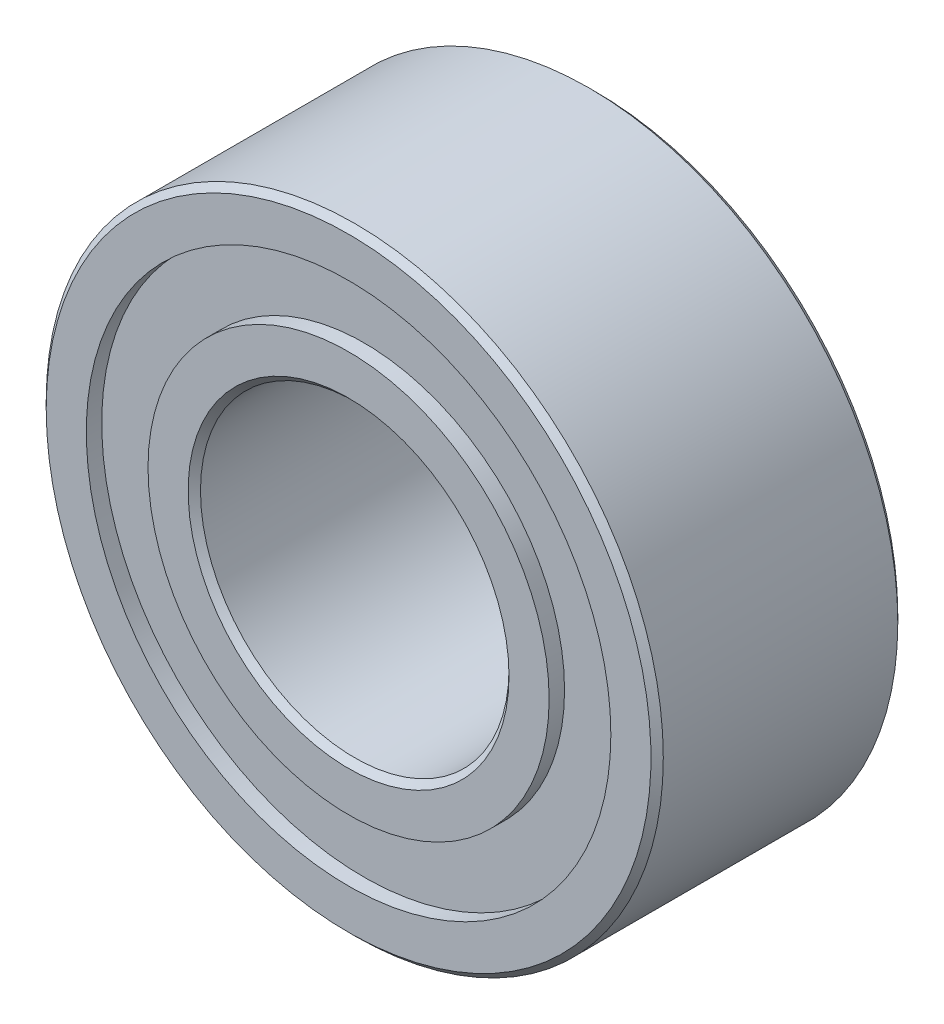
ISO-10303-21;
HEADER;
FILE_DESCRIPTION(('STEP AP214'),'2;1');
FILE_NAME('part.step','',(''),(''),'','','');
FILE_SCHEMA(('AUTOMOTIVE_DESIGN { 1 0 10303 214 1 1 1 1 }'));
ENDSEC;
DATA;
#1=APPLICATION_CONTEXT('core data for automotive mechanical design processes');
#2=APPLICATION_PROTOCOL_DEFINITION('international standard','automotive_design',2000,#1);
#3=PRODUCT_CONTEXT('',#1,'mechanical');
#4=PRODUCT('Part','Part','',(#3));
#5=PRODUCT_RELATED_PRODUCT_CATEGORY('part','',(#4));
#6=PRODUCT_DEFINITION_FORMATION('','',#4);
#7=PRODUCT_DEFINITION_CONTEXT('part definition',#1,'design');
#8=PRODUCT_DEFINITION('design','',#6,#7);
#9=PRODUCT_DEFINITION_SHAPE('','',#8);
#10=(LENGTH_UNIT() NAMED_UNIT(*) SI_UNIT(.MILLI.,.METRE.));
#11=(NAMED_UNIT(*) PLANE_ANGLE_UNIT() SI_UNIT($,.RADIAN.));
#12=(NAMED_UNIT(*) SI_UNIT($,.STERADIAN.) SOLID_ANGLE_UNIT());
#13=UNCERTAINTY_MEASURE_WITH_UNIT(LENGTH_MEASURE(1.E-05),#10,'distance_accuracy_value','');
#14=(GEOMETRIC_REPRESENTATION_CONTEXT(3) GLOBAL_UNCERTAINTY_ASSIGNED_CONTEXT((#13)) GLOBAL_UNIT_ASSIGNED_CONTEXT((#10,
#11,#12)) REPRESENTATION_CONTEXT('',''));
#15=CARTESIAN_POINT('',(0.,0.,0.));
#16=DIRECTION('',(0.,0.,1.));
#17=DIRECTION('',(1.,0.,0.));
#18=AXIS2_PLACEMENT_3D('',#15,#16,#17);
#19=CARTESIAN_POINT('',(0.,0.,0.));
#20=DIRECTION('',(0.,0.,1.));
#21=DIRECTION('',(1.,0.,0.));
#22=AXIS2_PLACEMENT_3D('',#19,#20,#21);
#23=CYLINDRICAL_SURFACE('',#22,2.5);
#24=CARTESIAN_POINT('',(0.,0.,-1.90000000003465));
#25=DIRECTION('',(0.,0.,-1.));
#26=DIRECTION('',(-1.,0.,0.));
#27=AXIS2_PLACEMENT_3D('',#24,#25,#26);
#28=CIRCLE('',#27,2.49999999988404);
#29=CARTESIAN_POINT('',(-2.49999999988404,0.,-1.90000000003465));
#30=VERTEX_POINT('',#29);
#31=EDGE_CURVE('E33',#30,#30,#28,.T.);
#32=ORIENTED_EDGE('',*,*,#31,.T.);
#33=EDGE_LOOP('',(#32));
#34=FACE_BOUND('',#33,.T.);
#35=CARTESIAN_POINT('',(0.,0.,1.90000000003465));
#36=DIRECTION('',(0.,0.,1.));
#37=DIRECTION('',(-1.,0.,0.));
#38=AXIS2_PLACEMENT_3D('',#35,#36,#37);
#39=CIRCLE('',#38,2.49999999994088);
#40=CARTESIAN_POINT('',(-2.49999999994088,0.,1.90000000003465));
#41=VERTEX_POINT('',#40);
#42=EDGE_CURVE('E36',#41,#41,#39,.T.);
#43=ORIENTED_EDGE('',*,*,#42,.T.);
#44=EDGE_LOOP('',(#43));
#45=FACE_BOUND('',#44,.T.);
#46=ADVANCED_FACE('F14',(#34,#45),#23,.F.);
#47=CARTESIAN_POINT('',(0.,0.,2.00000000006639));
#48=DIRECTION('',(0.,0.,1.));
#49=DIRECTION('',(1.,0.,0.));
#50=AXIS2_PLACEMENT_3D('',#47,#48,#49);
#51=CONICAL_SURFACE('',#50,2.59999999997262,0.785398163397448);
#52=ORIENTED_EDGE('',*,*,#42,.F.);
#53=EDGE_LOOP('',(#52));
#54=FACE_BOUND('',#53,.T.);
#55=CARTESIAN_POINT('',(0.,0.,2.00000000006639));
#56=DIRECTION('',(0.,0.,1.));
#57=DIRECTION('',(1.,0.,0.));
#58=AXIS2_PLACEMENT_3D('',#55,#56,#57);
#59=CIRCLE('',#58,2.59999999997262);
#60=CARTESIAN_POINT('',(2.59999999997262,0.,2.00000000006639));
#61=VERTEX_POINT('',#60);
#62=EDGE_CURVE('E17',#61,#61,#59,.F.);
#63=ORIENTED_EDGE('',*,*,#62,.F.);
#64=EDGE_LOOP('',(#63));
#65=FACE_BOUND('',#64,.T.);
#66=ADVANCED_FACE('F81',(#54,#65),#51,.F.);
#67=CARTESIAN_POINT('',(0.,0.,-2.00000000000955));
#68=DIRECTION('',(0.,0.,-1.));
#69=DIRECTION('',(-1.,0.,0.));
#70=AXIS2_PLACEMENT_3D('',#67,#68,#69);
#71=CONICAL_SURFACE('',#70,2.59999999991578,0.785398163397448);
#72=CARTESIAN_POINT('',(0.,0.,-2.00000000000955));
#73=DIRECTION('',(0.,0.,-1.));
#74=DIRECTION('',(-1.,0.,0.));
#75=AXIS2_PLACEMENT_3D('',#72,#73,#74);
#76=CIRCLE('',#75,2.59999999991578);
#77=CARTESIAN_POINT('',(-2.59999999991578,0.,-2.00000000000955));
#78=VERTEX_POINT('',#77);
#79=EDGE_CURVE('E71',#78,#78,#76,.F.);
#80=ORIENTED_EDGE('',*,*,#79,.F.);
#81=EDGE_LOOP('',(#80));
#82=FACE_BOUND('',#81,.T.);
#83=ORIENTED_EDGE('',*,*,#31,.F.);
#84=EDGE_LOOP('',(#83));
#85=FACE_BOUND('',#84,.T.);
#86=ADVANCED_FACE('F83',(#82,#85),#71,.F.);
#87=CARTESIAN_POINT('',(2.5,0.,2.));
#88=DIRECTION('',(0.,0.,1.));
#89=DIRECTION('',(1.,0.,0.));
#90=AXIS2_PLACEMENT_3D('',#87,#88,#89);
#91=PLANE('',#90);
#92=ORIENTED_EDGE('',*,*,#62,.T.);
#93=EDGE_LOOP('',(#92));
#94=FACE_BOUND('',#93,.T.);
#95=CARTESIAN_POINT('',(0.,0.,2.));
#96=DIRECTION('',(0.,0.,1.));
#97=DIRECTION('',(1.,0.,0.));
#98=AXIS2_PLACEMENT_3D('',#95,#96,#97);
#99=CIRCLE('',#98,3.25);
#100=CARTESIAN_POINT('',(3.25,0.,2.));
#101=VERTEX_POINT('',#100);
#102=EDGE_CURVE('E69',#101,#101,#99,.F.);
#103=ORIENTED_EDGE('',*,*,#102,.F.);
#104=EDGE_LOOP('',(#103));
#105=FACE_BOUND('',#104,.T.);
#106=ADVANCED_FACE('F78',(#94,#105),#91,.T.);
#107=CARTESIAN_POINT('',(3.25,0.,-2.));
#108=DIRECTION('',(0.,0.,-1.));
#109=DIRECTION('',(-1.,0.,0.));
#110=AXIS2_PLACEMENT_3D('',#107,#108,#109);
#111=PLANE('',#110);
#112=ORIENTED_EDGE('',*,*,#79,.T.);
#113=EDGE_LOOP('',(#112));
#114=FACE_BOUND('',#113,.T.);
#115=CARTESIAN_POINT('',(0.,0.,-2.));
#116=DIRECTION('',(0.,0.,1.));
#117=DIRECTION('',(1.,0.,0.));
#118=AXIS2_PLACEMENT_3D('',#115,#116,#117);
#119=CIRCLE('',#118,3.25);
#120=CARTESIAN_POINT('',(3.25,0.,-2.));
#121=VERTEX_POINT('',#120);
#122=EDGE_CURVE('E66',#121,#121,#119,.T.);
#123=ORIENTED_EDGE('',*,*,#122,.F.);
#124=EDGE_LOOP('',(#123));
#125=FACE_BOUND('',#124,.T.);
#126=ADVANCED_FACE('F140',(#114,#125),#111,.T.);
#127=CARTESIAN_POINT('',(0.,0.,1.875));
#128=DIRECTION('',(0.,0.,1.));
#129=DIRECTION('',(1.,0.,0.));
#130=AXIS2_PLACEMENT_3D('',#127,#128,#129);
#131=CYLINDRICAL_SURFACE('',#130,3.25);
#132=ORIENTED_EDGE('',*,*,#102,.T.);
#133=EDGE_LOOP('',(#132));
#134=FACE_BOUND('',#133,.T.);
#135=CARTESIAN_POINT('',(0.,0.,1.75000000000001));
#136=DIRECTION('',(0.,0.,1.));
#137=DIRECTION('',(1.,0.,0.));
#138=AXIS2_PLACEMENT_3D('',#135,#136,#137);
#139=CIRCLE('',#138,3.25);
#140=CARTESIAN_POINT('',(3.25,0.,1.75000000000001));
#141=VERTEX_POINT('',#140);
#142=EDGE_CURVE('E63',#141,#141,#139,.F.);
#143=ORIENTED_EDGE('',*,*,#142,.F.);
#144=EDGE_LOOP('',(#143));
#145=FACE_BOUND('',#144,.T.);
#146=ADVANCED_FACE('F136',(#134,#145),#131,.T.);
#147=CARTESIAN_POINT('',(0.,0.,-1.875));
#148=DIRECTION('',(0.,0.,1.));
#149=DIRECTION('',(1.,0.,0.));
#150=AXIS2_PLACEMENT_3D('',#147,#148,#149);
#151=CYLINDRICAL_SURFACE('',#150,3.25);
#152=CARTESIAN_POINT('',(0.,0.,-1.75000000000001));
#153=DIRECTION('',(0.,0.,1.));
#154=DIRECTION('',(1.,0.,0.));
#155=AXIS2_PLACEMENT_3D('',#152,#153,#154);
#156=CIRCLE('',#155,3.25);
#157=CARTESIAN_POINT('',(3.25,0.,-1.75000000000001));
#158=VERTEX_POINT('',#157);
#159=EDGE_CURVE('E60',#158,#158,#156,.T.);
#160=ORIENTED_EDGE('',*,*,#159,.F.);
#161=EDGE_LOOP('',(#160));
#162=FACE_BOUND('',#161,.T.);
#163=ORIENTED_EDGE('',*,*,#122,.T.);
#164=EDGE_LOOP('',(#163));
#165=FACE_BOUND('',#164,.T.);
#166=ADVANCED_FACE('F132',(#162,#165),#151,.T.);
#167=CARTESIAN_POINT('',(3.25,0.,1.75000000000001));
#168=DIRECTION('',(0.,0.,1.));
#169=DIRECTION('',(1.,0.,0.));
#170=AXIS2_PLACEMENT_3D('',#167,#168,#169);
#171=PLANE('',#170);
#172=ORIENTED_EDGE('',*,*,#142,.T.);
#173=EDGE_LOOP('',(#172));
#174=FACE_BOUND('',#173,.T.);
#175=CARTESIAN_POINT('',(0.,0.,1.75));
#176=DIRECTION('',(0.,0.,1.));
#177=DIRECTION('',(1.,0.,0.));
#178=AXIS2_PLACEMENT_3D('',#175,#176,#177);
#179=CIRCLE('',#178,4.24999999999999);
#180=CARTESIAN_POINT('',(4.24999999999999,0.,1.75));
#181=VERTEX_POINT('',#180);
#182=EDGE_CURVE('E57',#181,#181,#179,.T.);
#183=ORIENTED_EDGE('',*,*,#182,.T.);
#184=EDGE_LOOP('',(#183));
#185=FACE_BOUND('',#184,.T.);
#186=ADVANCED_FACE('F128',(#174,#185),#171,.T.);
#187=CARTESIAN_POINT('',(4.24999999999999,0.,-1.75));
#188=DIRECTION('',(0.,0.,-1.));
#189=DIRECTION('',(-1.,0.,0.));
#190=AXIS2_PLACEMENT_3D('',#187,#188,#189);
#191=PLANE('',#190);
#192=ORIENTED_EDGE('',*,*,#159,.T.);
#193=EDGE_LOOP('',(#192));
#194=FACE_BOUND('',#193,.T.);
#195=CARTESIAN_POINT('',(0.,0.,-1.75));
#196=DIRECTION('',(0.,0.,1.));
#197=DIRECTION('',(1.,0.,0.));
#198=AXIS2_PLACEMENT_3D('',#195,#196,#197);
#199=CIRCLE('',#198,4.24999999999999);
#200=CARTESIAN_POINT('',(4.24999999999999,0.,-1.75));
#201=VERTEX_POINT('',#200);
#202=EDGE_CURVE('E54',#201,#201,#199,.F.);
#203=ORIENTED_EDGE('',*,*,#202,.T.);
#204=EDGE_LOOP('',(#203));
#205=FACE_BOUND('',#204,.T.);
#206=ADVANCED_FACE('F124',(#194,#205),#191,.T.);
#207=CARTESIAN_POINT('',(0.,0.,1.875));
#208=DIRECTION('',(0.,0.,1.));
#209=DIRECTION('',(1.,0.,0.));
#210=AXIS2_PLACEMENT_3D('',#207,#208,#209);
#211=CYLINDRICAL_SURFACE('',#210,4.24999999999999);
#212=ORIENTED_EDGE('',*,*,#182,.F.);
#213=EDGE_LOOP('',(#212));
#214=FACE_BOUND('',#213,.T.);
#215=CARTESIAN_POINT('',(0.,0.,2.));
#216=DIRECTION('',(0.,0.,1.));
#217=DIRECTION('',(1.,0.,0.));
#218=AXIS2_PLACEMENT_3D('',#215,#216,#217);
#219=CIRCLE('',#218,4.24999999999999);
#220=CARTESIAN_POINT('',(4.24999999999999,0.,2.));
#221=VERTEX_POINT('',#220);
#222=EDGE_CURVE('E51',#221,#221,#219,.F.);
#223=ORIENTED_EDGE('',*,*,#222,.F.);
#224=EDGE_LOOP('',(#223));
#225=FACE_BOUND('',#224,.T.);
#226=ADVANCED_FACE('F120',(#214,#225),#211,.F.);
#227=CARTESIAN_POINT('',(0.,0.,-1.875));
#228=DIRECTION('',(0.,0.,1.));
#229=DIRECTION('',(1.,0.,0.));
#230=AXIS2_PLACEMENT_3D('',#227,#228,#229);
#231=CYLINDRICAL_SURFACE('',#230,4.24999999999999);
#232=CARTESIAN_POINT('',(0.,0.,-2.));
#233=DIRECTION('',(0.,0.,1.));
#234=DIRECTION('',(1.,0.,0.));
#235=AXIS2_PLACEMENT_3D('',#232,#233,#234);
#236=CIRCLE('',#235,4.24999999999999);
#237=CARTESIAN_POINT('',(4.24999999999999,0.,-2.));
#238=VERTEX_POINT('',#237);
#239=EDGE_CURVE('E48',#238,#238,#236,.T.);
#240=ORIENTED_EDGE('',*,*,#239,.F.);
#241=EDGE_LOOP('',(#240));
#242=FACE_BOUND('',#241,.T.);
#243=ORIENTED_EDGE('',*,*,#202,.F.);
#244=EDGE_LOOP('',(#243));
#245=FACE_BOUND('',#244,.T.);
#246=ADVANCED_FACE('F116',(#242,#245),#231,.F.);
#247=CARTESIAN_POINT('',(4.24999999999999,0.,2.));
#248=DIRECTION('',(0.,0.,1.));
#249=DIRECTION('',(1.,0.,0.));
#250=AXIS2_PLACEMENT_3D('',#247,#248,#249);
#251=PLANE('',#250);
#252=ORIENTED_EDGE('',*,*,#222,.T.);
#253=EDGE_LOOP('',(#252));
#254=FACE_BOUND('',#253,.T.);
#255=CARTESIAN_POINT('',(0.,0.,2.00000000006639));
#256=DIRECTION('',(0.,0.,-1.));
#257=DIRECTION('',(-1.,0.,0.));
#258=AXIS2_PLACEMENT_3D('',#255,#256,#257);
#259=CIRCLE('',#258,4.89999999996371);
#260=CARTESIAN_POINT('',(-4.89999999996371,0.,2.00000000006639));
#261=VERTEX_POINT('',#260);
#262=EDGE_CURVE('E45',#261,#261,#259,.T.);
#263=ORIENTED_EDGE('',*,*,#262,.F.);
#264=EDGE_LOOP('',(#263));
#265=FACE_BOUND('',#264,.T.);
#266=ADVANCED_FACE('F112',(#254,#265),#251,.T.);
#267=CARTESIAN_POINT('',(4.99999999999999,0.,-2.));
#268=DIRECTION('',(0.,0.,-1.));
#269=DIRECTION('',(-1.,0.,0.));
#270=AXIS2_PLACEMENT_3D('',#267,#268,#269);
#271=PLANE('',#270);
#272=ORIENTED_EDGE('',*,*,#239,.T.);
#273=EDGE_LOOP('',(#272));
#274=FACE_BOUND('',#273,.T.);
#275=CARTESIAN_POINT('',(0.,0.,-2.00000000000955));
#276=DIRECTION('',(0.,0.,1.));
#277=DIRECTION('',(1.,0.,0.));
#278=AXIS2_PLACEMENT_3D('',#275,#276,#277);
#279=CIRCLE('',#278,4.89999999996371);
#280=CARTESIAN_POINT('',(4.89999999996371,0.,-2.00000000000955));
#281=VERTEX_POINT('',#280);
#282=EDGE_CURVE('E26',#281,#281,#279,.T.);
#283=ORIENTED_EDGE('',*,*,#282,.F.);
#284=EDGE_LOOP('',(#283));
#285=FACE_BOUND('',#284,.T.);
#286=ADVANCED_FACE('F108',(#274,#285),#271,.T.);
#287=CARTESIAN_POINT('',(0.,0.,1.9000000000915));
#288=DIRECTION('',(0.,0.,-1.));
#289=DIRECTION('',(-1.,0.,0.));
#290=AXIS2_PLACEMENT_3D('',#287,#288,#289);
#291=CONICAL_SURFACE('',#290,4.99999999993861,0.785398163397448);
#292=ORIENTED_EDGE('',*,*,#262,.T.);
#293=EDGE_LOOP('',(#292));
#294=FACE_BOUND('',#293,.T.);
#295=CARTESIAN_POINT('',(0.,0.,1.9));
#296=DIRECTION('',(0.,0.,1.));
#297=DIRECTION('',(1.,0.,0.));
#298=AXIS2_PLACEMENT_3D('',#295,#296,#297);
#299=CIRCLE('',#298,4.99999999999999);
#300=CARTESIAN_POINT('',(4.99999999999999,0.,1.9));
#301=VERTEX_POINT('',#300);
#302=EDGE_CURVE('E21',#301,#301,#299,.F.);
#303=ORIENTED_EDGE('',*,*,#302,.F.);
#304=EDGE_LOOP('',(#303));
#305=FACE_BOUND('',#304,.T.);
#306=ADVANCED_FACE('F101',(#294,#305),#291,.T.);
#307=CARTESIAN_POINT('',(0.,0.,-1.89999999997781));
#308=DIRECTION('',(0.,0.,1.));
#309=DIRECTION('',(1.,0.,0.));
#310=AXIS2_PLACEMENT_3D('',#307,#308,#309);
#311=CONICAL_SURFACE('',#310,4.99999999999545,0.785398163397448);
#312=CARTESIAN_POINT('',(0.,0.,-1.9));
#313=DIRECTION('',(0.,0.,1.));
#314=DIRECTION('',(1.,0.,0.));
#315=AXIS2_PLACEMENT_3D('',#312,#313,#314);
#316=CIRCLE('',#315,4.99999999999999);
#317=CARTESIAN_POINT('',(4.99999999999999,0.,-1.9));
#318=VERTEX_POINT('',#317);
#319=EDGE_CURVE('E10',#318,#318,#316,.T.);
#320=ORIENTED_EDGE('',*,*,#319,.F.);
#321=EDGE_LOOP('',(#320));
#322=FACE_BOUND('',#321,.T.);
#323=ORIENTED_EDGE('',*,*,#282,.T.);
#324=EDGE_LOOP('',(#323));
#325=FACE_BOUND('',#324,.T.);
#326=ADVANCED_FACE('F96',(#322,#325),#311,.T.);
#327=CARTESIAN_POINT('',(0.,0.,0.));
#328=DIRECTION('',(0.,0.,1.));
#329=DIRECTION('',(1.,0.,0.));
#330=AXIS2_PLACEMENT_3D('',#327,#328,#329);
#331=CYLINDRICAL_SURFACE('',#330,4.99999999999999);
#332=ORIENTED_EDGE('',*,*,#319,.T.);
#333=EDGE_LOOP('',(#332));
#334=FACE_BOUND('',#333,.T.);
#335=ORIENTED_EDGE('',*,*,#302,.T.);
#336=EDGE_LOOP('',(#335));
#337=FACE_BOUND('',#336,.T.);
#338=ADVANCED_FACE('F94',(#334,#337),#331,.T.);
#339=CLOSED_SHELL('',(#46,#66,#86,#106,#126,#146,#166,#186,#206,#226,#246,#266,#286,#306,#326,#338));
#340=MANIFOLD_SOLID_BREP('B1',#339);
#341=ADVANCED_BREP_SHAPE_REPRESENTATION('',(#18,#340),#14);
#342=SHAPE_DEFINITION_REPRESENTATION(#9,#341);
ENDSEC;
END-ISO-10303-21;
